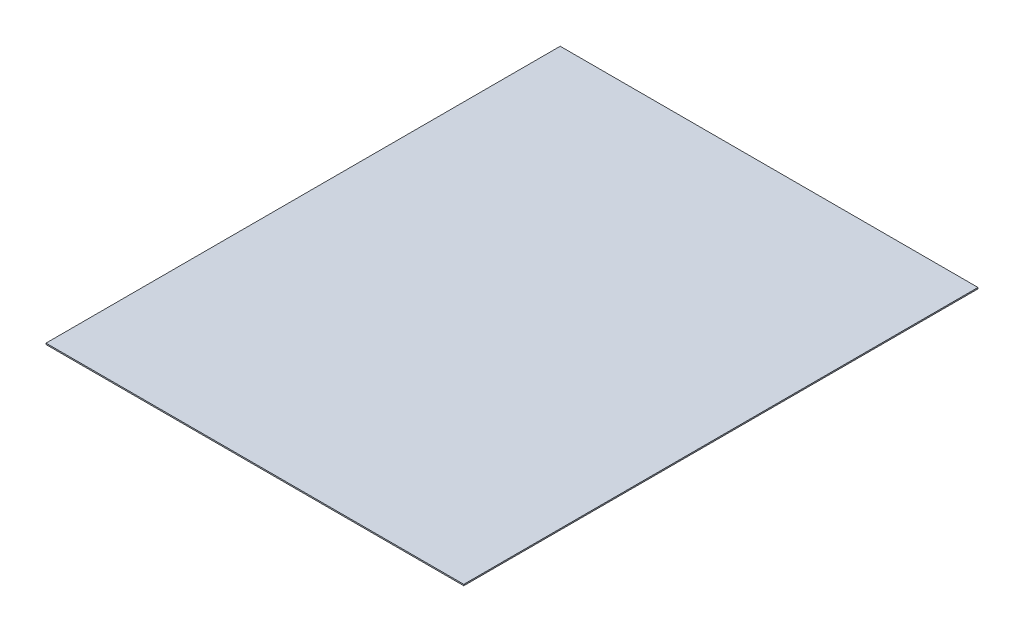
ISO-10303-21;
HEADER;
FILE_DESCRIPTION(('STEP AP214'),'2;1');
FILE_NAME('part.step','',(''),(''),'','','');
FILE_SCHEMA(('AUTOMOTIVE_DESIGN { 1 0 10303 214 1 1 1 1 }'));
ENDSEC;
DATA;
#1=APPLICATION_CONTEXT('core data for automotive mechanical design processes');
#2=APPLICATION_PROTOCOL_DEFINITION('international standard','automotive_design',2000,#1);
#3=PRODUCT_CONTEXT('',#1,'mechanical');
#4=PRODUCT('Part','Part','',(#3));
#5=PRODUCT_RELATED_PRODUCT_CATEGORY('part','',(#4));
#6=PRODUCT_DEFINITION_FORMATION('','',#4);
#7=PRODUCT_DEFINITION_CONTEXT('part definition',#1,'design');
#8=PRODUCT_DEFINITION('design','',#6,#7);
#9=PRODUCT_DEFINITION_SHAPE('','',#8);
#10=(LENGTH_UNIT() NAMED_UNIT(*) SI_UNIT(.MILLI.,.METRE.));
#11=(NAMED_UNIT(*) PLANE_ANGLE_UNIT() SI_UNIT($,.RADIAN.));
#12=(NAMED_UNIT(*) SI_UNIT($,.STERADIAN.) SOLID_ANGLE_UNIT());
#13=UNCERTAINTY_MEASURE_WITH_UNIT(LENGTH_MEASURE(1.E-05),#10,'distance_accuracy_value','');
#14=(GEOMETRIC_REPRESENTATION_CONTEXT(3) GLOBAL_UNCERTAINTY_ASSIGNED_CONTEXT((#13)) GLOBAL_UNIT_ASSIGNED_CONTEXT((#10,
#11,#12)) REPRESENTATION_CONTEXT('',''));
#15=CARTESIAN_POINT('',(0.,0.,0.));
#16=DIRECTION('',(0.,0.,1.));
#17=DIRECTION('',(1.,0.,0.));
#18=AXIS2_PLACEMENT_3D('',#15,#16,#17);
#19=CARTESIAN_POINT('',(495.3,2.9972,-609.6));
#20=DIRECTION('',(-1.,0.,0.));
#21=DIRECTION('',(0.,0.,1.));
#22=AXIS2_PLACEMENT_3D('',#19,#20,#21);
#23=PLANE('',#22);
#24=DIRECTION('',(0.,0.,-1.));
#25=VECTOR('',#24,1.);
#26=CARTESIAN_POINT('',(495.3,0.,-609.6));
#27=LINE('',#26,#25);
#28=CARTESIAN_POINT('',(495.3,0.,609.6));
#29=VERTEX_POINT('',#28);
#30=CARTESIAN_POINT('',(495.3,0.,-609.6));
#31=VERTEX_POINT('',#30);
#32=EDGE_CURVE('E107',#29,#31,#27,.T.);
#33=ORIENTED_EDGE('',*,*,#32,.T.);
#34=DIRECTION('',(0.,-1.,0.));
#35=VECTOR('',#34,1.);
#36=CARTESIAN_POINT('',(495.3,2.9972,-609.6));
#37=LINE('',#36,#35);
#38=CARTESIAN_POINT('',(495.3,2.9972,-609.6));
#39=VERTEX_POINT('',#38);
#40=EDGE_CURVE('E11',#39,#31,#37,.T.);
#41=ORIENTED_EDGE('',*,*,#40,.F.);
#42=DIRECTION('',(0.,0.,-1.));
#43=VECTOR('',#42,1.);
#44=CARTESIAN_POINT('',(495.3,2.9972,-609.6));
#45=LINE('',#44,#43);
#46=CARTESIAN_POINT('',(495.3,2.9972,609.6));
#47=VERTEX_POINT('',#46);
#48=EDGE_CURVE('E91',#47,#39,#45,.T.);
#49=ORIENTED_EDGE('',*,*,#48,.F.);
#50=DIRECTION('',(0.,-1.,0.));
#51=VECTOR('',#50,1.);
#52=CARTESIAN_POINT('',(495.3,2.9972,609.6));
#53=LINE('',#52,#51);
#54=EDGE_CURVE('E103',#47,#29,#53,.T.);
#55=ORIENTED_EDGE('',*,*,#54,.T.);
#56=EDGE_LOOP('',(#33,#41,#49,#55));
#57=FACE_BOUND('',#56,.T.);
#58=ADVANCED_FACE('F39',(#57),#23,.F.);
#59=CARTESIAN_POINT('',(-495.3,2.9972,-609.6));
#60=DIRECTION('',(0.,0.,1.));
#61=DIRECTION('',(1.,0.,0.));
#62=AXIS2_PLACEMENT_3D('',#59,#60,#61);
#63=PLANE('',#62);
#64=DIRECTION('',(-1.,0.,0.));
#65=VECTOR('',#64,1.);
#66=CARTESIAN_POINT('',(-495.3,0.,-609.6));
#67=LINE('',#66,#65);
#68=CARTESIAN_POINT('',(-495.3,0.,-609.6));
#69=VERTEX_POINT('',#68);
#70=EDGE_CURVE('E96',#31,#69,#67,.T.);
#71=ORIENTED_EDGE('',*,*,#70,.T.);
#72=DIRECTION('',(0.,-1.,0.));
#73=VECTOR('',#72,1.);
#74=CARTESIAN_POINT('',(-495.3,2.9972,-609.6));
#75=LINE('',#74,#73);
#76=CARTESIAN_POINT('',(-495.3,2.9972,-609.6));
#77=VERTEX_POINT('',#76);
#78=EDGE_CURVE('E48',#77,#69,#75,.T.);
#79=ORIENTED_EDGE('',*,*,#78,.F.);
#80=DIRECTION('',(-1.,0.,0.));
#81=VECTOR('',#80,1.);
#82=CARTESIAN_POINT('',(-495.3,2.9972,-609.6));
#83=LINE('',#82,#81);
#84=EDGE_CURVE('E86',#39,#77,#83,.T.);
#85=ORIENTED_EDGE('',*,*,#84,.F.);
#86=ORIENTED_EDGE('',*,*,#40,.T.);
#87=EDGE_LOOP('',(#71,#79,#85,#86));
#88=FACE_BOUND('',#87,.T.);
#89=ADVANCED_FACE('F95',(#88),#63,.F.);
#90=CARTESIAN_POINT('',(-495.3,2.9972,-609.6));
#91=DIRECTION('',(1.,0.,0.));
#92=DIRECTION('',(0.,0.,-1.));
#93=AXIS2_PLACEMENT_3D('',#90,#91,#92);
#94=PLANE('',#93);
#95=DIRECTION('',(0.,0.,1.));
#96=VECTOR('',#95,1.);
#97=CARTESIAN_POINT('',(-495.3,0.,-609.6));
#98=LINE('',#97,#96);
#99=CARTESIAN_POINT('',(-495.3,0.,609.6));
#100=VERTEX_POINT('',#99);
#101=EDGE_CURVE('E73',#69,#100,#98,.T.);
#102=ORIENTED_EDGE('',*,*,#101,.T.);
#103=DIRECTION('',(0.,-1.,0.));
#104=VECTOR('',#103,1.);
#105=CARTESIAN_POINT('',(-495.3,2.9972,609.6));
#106=LINE('',#105,#104);
#107=CARTESIAN_POINT('',(-495.3,2.9972,609.6));
#108=VERTEX_POINT('',#107);
#109=EDGE_CURVE('E98',#108,#100,#106,.T.);
#110=ORIENTED_EDGE('',*,*,#109,.F.);
#111=DIRECTION('',(0.,0.,1.));
#112=VECTOR('',#111,1.);
#113=CARTESIAN_POINT('',(-495.3,2.9972,-609.6));
#114=LINE('',#113,#112);
#115=EDGE_CURVE('E89',#77,#108,#114,.T.);
#116=ORIENTED_EDGE('',*,*,#115,.F.);
#117=ORIENTED_EDGE('',*,*,#78,.T.);
#118=EDGE_LOOP('',(#102,#110,#116,#117));
#119=FACE_BOUND('',#118,.T.);
#120=ADVANCED_FACE('F99',(#119),#94,.F.);
#121=CARTESIAN_POINT('',(-495.3,2.9972,609.6));
#122=DIRECTION('',(0.,0.,-1.));
#123=DIRECTION('',(-1.,0.,0.));
#124=AXIS2_PLACEMENT_3D('',#121,#122,#123);
#125=PLANE('',#124);
#126=DIRECTION('',(1.,0.,0.));
#127=VECTOR('',#126,1.);
#128=CARTESIAN_POINT('',(-495.3,0.,609.6));
#129=LINE('',#128,#127);
#130=EDGE_CURVE('E79',#100,#29,#129,.T.);
#131=ORIENTED_EDGE('',*,*,#130,.T.);
#132=ORIENTED_EDGE('',*,*,#54,.F.);
#133=DIRECTION('',(1.,0.,0.));
#134=VECTOR('',#133,1.);
#135=CARTESIAN_POINT('',(-495.3,2.9972,609.6));
#136=LINE('',#135,#134);
#137=EDGE_CURVE('E56',#108,#47,#136,.T.);
#138=ORIENTED_EDGE('',*,*,#137,.F.);
#139=ORIENTED_EDGE('',*,*,#109,.T.);
#140=EDGE_LOOP('',(#131,#132,#138,#139));
#141=FACE_BOUND('',#140,.T.);
#142=ADVANCED_FACE('F120',(#141),#125,.F.);
#143=CARTESIAN_POINT('',(0.,2.9972,0.));
#144=DIRECTION('',(0.,1.,0.));
#145=DIRECTION('',(0.,0.,1.));
#146=AXIS2_PLACEMENT_3D('',#143,#144,#145);
#147=PLANE('',#146);
#148=ORIENTED_EDGE('',*,*,#48,.T.);
#149=ORIENTED_EDGE('',*,*,#84,.T.);
#150=ORIENTED_EDGE('',*,*,#115,.T.);
#151=ORIENTED_EDGE('',*,*,#137,.T.);
#152=EDGE_LOOP('',(#148,#149,#150,#151));
#153=FACE_BOUND('',#152,.T.);
#154=ADVANCED_FACE('F87',(#153),#147,.T.);
#155=CARTESIAN_POINT('',(0.,0.,0.));
#156=DIRECTION('',(0.,1.,0.));
#157=DIRECTION('',(0.,0.,1.));
#158=AXIS2_PLACEMENT_3D('',#155,#156,#157);
#159=PLANE('',#158);
#160=ORIENTED_EDGE('',*,*,#32,.F.);
#161=ORIENTED_EDGE('',*,*,#130,.F.);
#162=ORIENTED_EDGE('',*,*,#101,.F.);
#163=ORIENTED_EDGE('',*,*,#70,.F.);
#164=EDGE_LOOP('',(#160,#161,#162,#163));
#165=FACE_BOUND('',#164,.T.);
#166=ADVANCED_FACE('F123',(#165),#159,.F.);
#167=CLOSED_SHELL('',(#58,#89,#120,#142,#154,#166));
#168=MANIFOLD_SOLID_BREP('B2',#167);
#169=ADVANCED_BREP_SHAPE_REPRESENTATION('',(#18,#168),#14);
#170=SHAPE_DEFINITION_REPRESENTATION(#9,#169);
ENDSEC;
END-ISO-10303-21;
